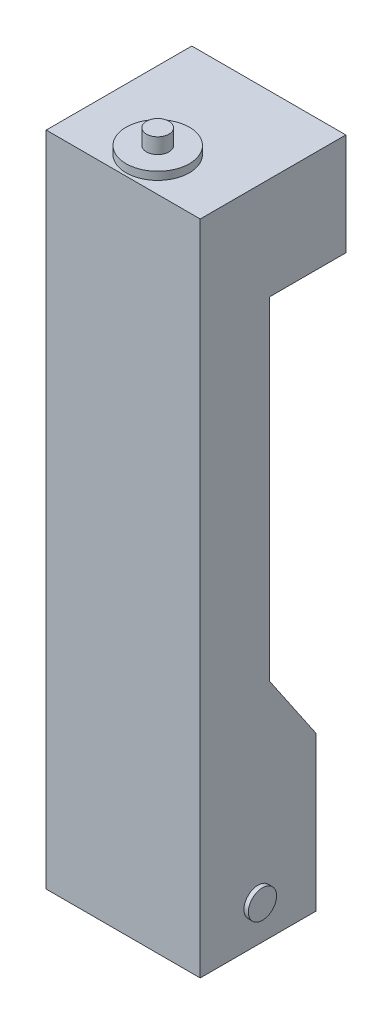
ISO-10303-21;
HEADER;
FILE_DESCRIPTION(('STEP AP214'),'2;1');
FILE_NAME('part.step','',(''),(''),'','','');
FILE_SCHEMA(('AUTOMOTIVE_DESIGN { 1 0 10303 214 1 1 1 1 }'));
ENDSEC;
DATA;
#1=APPLICATION_CONTEXT('core data for automotive mechanical design processes');
#2=APPLICATION_PROTOCOL_DEFINITION('international standard','automotive_design',2000,#1);
#3=PRODUCT_CONTEXT('',#1,'mechanical');
#4=PRODUCT('Part','Part','',(#3));
#5=PRODUCT_RELATED_PRODUCT_CATEGORY('part','',(#4));
#6=PRODUCT_DEFINITION_FORMATION('','',#4);
#7=PRODUCT_DEFINITION_CONTEXT('part definition',#1,'design');
#8=PRODUCT_DEFINITION('design','',#6,#7);
#9=PRODUCT_DEFINITION_SHAPE('','',#8);
#10=(LENGTH_UNIT() NAMED_UNIT(*) SI_UNIT(.MILLI.,.METRE.));
#11=(NAMED_UNIT(*) PLANE_ANGLE_UNIT() SI_UNIT($,.RADIAN.));
#12=(NAMED_UNIT(*) SI_UNIT($,.STERADIAN.) SOLID_ANGLE_UNIT());
#13=UNCERTAINTY_MEASURE_WITH_UNIT(LENGTH_MEASURE(1.E-05),#10,'distance_accuracy_value','');
#14=(GEOMETRIC_REPRESENTATION_CONTEXT(3) GLOBAL_UNCERTAINTY_ASSIGNED_CONTEXT((#13)) GLOBAL_UNIT_ASSIGNED_CONTEXT((#10,
#11,#12)) REPRESENTATION_CONTEXT('',''));
#15=CARTESIAN_POINT('',(0.,0.,0.));
#16=DIRECTION('',(0.,0.,1.));
#17=DIRECTION('',(1.,0.,0.));
#18=AXIS2_PLACEMENT_3D('',#15,#16,#17);
#19=CARTESIAN_POINT('',(-17.8,179.95,20.1));
#20=DIRECTION('',(0.,-1.,0.));
#21=DIRECTION('',(0.,0.,-1.));
#22=AXIS2_PLACEMENT_3D('',#19,#20,#21);
#23=PLANE('',#22);
#24=DIRECTION('',(-1.,0.,0.));
#25=VECTOR('',#24,1.);
#26=CARTESIAN_POINT('',(26.7625,179.95,-3.9));
#27=LINE('',#26,#25);
#28=CARTESIAN_POINT('',(26.7625,179.95,-3.9));
#29=VERTEX_POINT('',#28);
#30=CARTESIAN_POINT('',(-26.7625,179.95,-3.9));
#31=VERTEX_POINT('',#30);
#32=EDGE_CURVE('E230',#29,#31,#27,.T.);
#33=ORIENTED_EDGE('',*,*,#32,.T.);
#34=DIRECTION('',(0.,0.,1.));
#35=VECTOR('',#34,1.);
#36=CARTESIAN_POINT('',(-26.7625,179.95,-30.5));
#37=LINE('',#36,#35);
#38=CARTESIAN_POINT('',(-26.7625,179.95,-30.5));
#39=VERTEX_POINT('',#38);
#40=EDGE_CURVE('E218',#39,#31,#37,.T.);
#41=ORIENTED_EDGE('',*,*,#40,.F.);
#42=DIRECTION('',(-1.,0.,0.));
#43=VECTOR('',#42,1.);
#44=CARTESIAN_POINT('',(17.8,179.95,-30.5));
#45=LINE('',#44,#43);
#46=CARTESIAN_POINT('',(26.7625,179.95,-30.5));
#47=VERTEX_POINT('',#46);
#48=EDGE_CURVE('E247',#47,#39,#45,.T.);
#49=ORIENTED_EDGE('',*,*,#48,.F.);
#50=DIRECTION('',(0.,0.,-1.));
#51=VECTOR('',#50,1.);
#52=CARTESIAN_POINT('',(26.7625,179.95,20.1));
#53=LINE('',#52,#51);
#54=EDGE_CURVE('E231',#29,#47,#53,.T.);
#55=ORIENTED_EDGE('',*,*,#54,.F.);
#56=EDGE_LOOP('',(#33,#41,#49,#55));
#57=FACE_BOUND('',#56,.T.);
#58=ADVANCED_FACE('F33',(#57),#23,.T.);
#59=CARTESIAN_POINT('',(26.7625,64.4235294117647,-3.9));
#60=DIRECTION('',(0.,0.,1.));
#61=DIRECTION('',(0.,-1.,0.));
#62=AXIS2_PLACEMENT_3D('',#59,#60,#61);
#63=PLANE('',#62);
#64=DIRECTION('',(-1.,0.,0.));
#65=VECTOR('',#64,1.);
#66=CARTESIAN_POINT('',(26.7625,64.4235294117647,-3.9));
#67=LINE('',#66,#65);
#68=CARTESIAN_POINT('',(26.7625,64.4235294117647,-3.9));
#69=VERTEX_POINT('',#68);
#70=CARTESIAN_POINT('',(-26.7625,64.4235294117647,-3.9));
#71=VERTEX_POINT('',#70);
#72=EDGE_CURVE('E277',#69,#71,#67,.T.);
#73=ORIENTED_EDGE('',*,*,#72,.T.);
#74=DIRECTION('',(0.,1.,0.));
#75=VECTOR('',#74,1.);
#76=CARTESIAN_POINT('',(-26.7625,64.4235294117647,-3.9));
#77=LINE('',#76,#75);
#78=EDGE_CURVE('E256',#71,#31,#77,.T.);
#79=ORIENTED_EDGE('',*,*,#78,.T.);
#80=ORIENTED_EDGE('',*,*,#32,.F.);
#81=DIRECTION('',(0.,1.,0.));
#82=VECTOR('',#81,1.);
#83=CARTESIAN_POINT('',(26.7625,64.4235294117647,-3.9));
#84=LINE('',#83,#82);
#85=EDGE_CURVE('E272',#69,#29,#84,.T.);
#86=ORIENTED_EDGE('',*,*,#85,.F.);
#87=EDGE_LOOP('',(#73,#79,#80,#86));
#88=FACE_BOUND('',#87,.T.);
#89=ADVANCED_FACE('F344',(#88),#63,.F.);
#90=CARTESIAN_POINT('',(0.,218.2,8.1));
#91=DIRECTION('',(0.,1.,0.));
#92=DIRECTION('',(0.,0.,1.));
#93=AXIS2_PLACEMENT_3D('',#90,#91,#92);
#94=PLANE('',#93);
#95=CARTESIAN_POINT('',(0.,218.2,8.1));
#96=DIRECTION('',(0.,1.,0.));
#97=DIRECTION('',(0.,0.,1.));
#98=AXIS2_PLACEMENT_3D('',#95,#96,#97);
#99=CIRCLE('',#98,11.);
#100=CARTESIAN_POINT('',(0.,218.2,19.1));
#101=VERTEX_POINT('',#100);
#102=EDGE_CURVE('E241',#101,#101,#99,.T.);
#103=ORIENTED_EDGE('',*,*,#102,.T.);
#104=EDGE_LOOP('',(#103));
#105=FACE_BOUND('',#104,.T.);
#106=CARTESIAN_POINT('',(0.,218.2,8.1));
#107=DIRECTION('',(0.,1.,0.));
#108=DIRECTION('',(0.,0.,1.));
#109=AXIS2_PLACEMENT_3D('',#106,#107,#108);
#110=CIRCLE('',#109,3.9);
#111=CARTESIAN_POINT('',(0.,218.2,12.));
#112=VERTEX_POINT('',#111);
#113=EDGE_CURVE('E237',#112,#112,#110,.T.);
#114=ORIENTED_EDGE('',*,*,#113,.F.);
#115=EDGE_LOOP('',(#114));
#116=FACE_BOUND('',#115,.T.);
#117=ADVANCED_FACE('F334',(#105,#116),#94,.T.);
#118=CARTESIAN_POINT('',(-17.8,215.45,20.1));
#119=DIRECTION('',(0.,-1.,0.));
#120=DIRECTION('',(0.,0.,-1.));
#121=AXIS2_PLACEMENT_3D('',#118,#119,#120);
#122=PLANE('',#121);
#123=DIRECTION('',(-1.,0.,0.));
#124=VECTOR('',#123,1.);
#125=CARTESIAN_POINT('',(17.8,215.45,-30.5));
#126=LINE('',#125,#124);
#127=CARTESIAN_POINT('',(26.7625,215.45,-30.5));
#128=VERTEX_POINT('',#127);
#129=CARTESIAN_POINT('',(-26.7625,215.45,-30.5));
#130=VERTEX_POINT('',#129);
#131=EDGE_CURVE('E249',#128,#130,#126,.T.);
#132=ORIENTED_EDGE('',*,*,#131,.T.);
#133=DIRECTION('',(0.,0.,-1.));
#134=VECTOR('',#133,1.);
#135=CARTESIAN_POINT('',(-26.7625,215.45,-30.5));
#136=LINE('',#135,#134);
#137=CARTESIAN_POINT('',(-26.7625,215.45,20.1));
#138=VERTEX_POINT('',#137);
#139=EDGE_CURVE('E217',#138,#130,#136,.T.);
#140=ORIENTED_EDGE('',*,*,#139,.F.);
#141=DIRECTION('',(1.,0.,0.));
#142=VECTOR('',#141,1.);
#143=CARTESIAN_POINT('',(17.8,215.45,20.1));
#144=LINE('',#143,#142);
#145=CARTESIAN_POINT('',(26.7625,215.45,20.1));
#146=VERTEX_POINT('',#145);
#147=EDGE_CURVE('E246',#138,#146,#144,.T.);
#148=ORIENTED_EDGE('',*,*,#147,.T.);
#149=DIRECTION('',(0.,0.,1.));
#150=VECTOR('',#149,1.);
#151=CARTESIAN_POINT('',(26.7625,215.45,20.1));
#152=LINE('',#151,#150);
#153=EDGE_CURVE('E221',#128,#146,#152,.T.);
#154=ORIENTED_EDGE('',*,*,#153,.F.);
#155=EDGE_LOOP('',(#132,#140,#148,#154));
#156=FACE_BOUND('',#155,.T.);
#157=CARTESIAN_POINT('',(0.,215.45,8.1));
#158=DIRECTION('',(0.,-1.,0.));
#159=DIRECTION('',(0.,0.,-1.));
#160=AXIS2_PLACEMENT_3D('',#157,#158,#159);
#161=CIRCLE('',#160,11.);
#162=CARTESIAN_POINT('',(0.,215.45,-2.9));
#163=VERTEX_POINT('',#162);
#164=EDGE_CURVE('E207',#163,#163,#161,.F.);
#165=ORIENTED_EDGE('',*,*,#164,.F.);
#166=EDGE_LOOP('',(#165));
#167=FACE_BOUND('',#166,.T.);
#168=ADVANCED_FACE('F331',(#156,#167),#122,.F.);
#169=CARTESIAN_POINT('',(-20.5,48.1,-20.1));
#170=DIRECTION('',(1.,0.,0.));
#171=DIRECTION('',(0.,0.,-1.));
#172=AXIS2_PLACEMENT_3D('',#169,#170,#171);
#173=PLANE('',#172);
#174=DIRECTION('',(0.,-0.826926502069529,0.562310021407278));
#175=VECTOR('',#174,1.);
#176=CARTESIAN_POINT('',(-20.5,-13.,-15.));
#177=LINE('',#176,#175);
#178=CARTESIAN_POINT('',(-20.5,-5.52324803401495,-20.0841913368698));
#179=VERTEX_POINT('',#178);
#180=CARTESIAN_POINT('',(-20.5,-5.49999999999996,-20.1));
#181=VERTEX_POINT('',#180);
#182=EDGE_CURVE('E306',#179,#181,#177,.F.);
#183=ORIENTED_EDGE('',*,*,#182,.F.);
#184=DIRECTION('',(0.,1.,0.));
#185=VECTOR('',#184,1.);
#186=CARTESIAN_POINT('',(-20.5,48.1,-20.0841913368698));
#187=LINE('',#186,#185);
#188=CARTESIAN_POINT('',(-20.5,15.2,-20.0841913368698));
#189=VERTEX_POINT('',#188);
#190=EDGE_CURVE('E196',#179,#189,#187,.T.);
#191=ORIENTED_EDGE('',*,*,#190,.T.);
#192=DIRECTION('',(0.,0.,1.));
#193=VECTOR('',#192,1.);
#194=CARTESIAN_POINT('',(-20.5,15.2,-20.1));
#195=LINE('',#194,#193);
#196=CARTESIAN_POINT('',(-20.5,15.2,-20.1));
#197=VERTEX_POINT('',#196);
#198=EDGE_CURVE('E292',#197,#189,#195,.T.);
#199=ORIENTED_EDGE('',*,*,#198,.F.);
#200=DIRECTION('',(0.,-1.,0.));
#201=VECTOR('',#200,1.);
#202=CARTESIAN_POINT('',(-20.5,48.1,-20.1));
#203=LINE('',#202,#201);
#204=EDGE_CURVE('E320',#197,#181,#203,.T.);
#205=ORIENTED_EDGE('',*,*,#204,.T.);
#206=EDGE_LOOP('',(#183,#191,#199,#205));
#207=FACE_BOUND('',#206,.T.);
#208=ADVANCED_FACE('F333',(#207),#173,.F.);
#209=CARTESIAN_POINT('',(20.5,48.1,-20.1));
#210=DIRECTION('',(-1.,0.,0.));
#211=DIRECTION('',(0.,0.,1.));
#212=AXIS2_PLACEMENT_3D('',#209,#210,#211);
#213=PLANE('',#212);
#214=DIRECTION('',(0.,0.,1.));
#215=VECTOR('',#214,1.);
#216=CARTESIAN_POINT('',(20.5,15.2,-20.1));
#217=LINE('',#216,#215);
#218=CARTESIAN_POINT('',(20.5,15.2,-20.1));
#219=VERTEX_POINT('',#218);
#220=CARTESIAN_POINT('',(20.5,15.2,-20.0841913368698));
#221=VERTEX_POINT('',#220);
#222=EDGE_CURVE('E279',#219,#221,#217,.T.);
#223=ORIENTED_EDGE('',*,*,#222,.T.);
#224=DIRECTION('',(0.,-1.,0.));
#225=VECTOR('',#224,1.);
#226=CARTESIAN_POINT('',(20.5,48.1,-20.0841913368698));
#227=LINE('',#226,#225);
#228=CARTESIAN_POINT('',(20.5,-5.52324803401495,-20.0841913368698));
#229=VERTEX_POINT('',#228);
#230=EDGE_CURVE('E191',#221,#229,#227,.T.);
#231=ORIENTED_EDGE('',*,*,#230,.T.);
#232=DIRECTION('',(0.,0.826926502069529,-0.562310021407278));
#233=VECTOR('',#232,1.);
#234=CARTESIAN_POINT('',(20.5,-13.,-15.));
#235=LINE('',#234,#233);
#236=CARTESIAN_POINT('',(20.5,-5.49999999999996,-20.1));
#237=VERTEX_POINT('',#236);
#238=EDGE_CURVE('E300',#237,#229,#235,.F.);
#239=ORIENTED_EDGE('',*,*,#238,.F.);
#240=DIRECTION('',(0.,-1.,0.));
#241=VECTOR('',#240,1.);
#242=CARTESIAN_POINT('',(20.5,48.1,-20.1));
#243=LINE('',#242,#241);
#244=EDGE_CURVE('E323',#219,#237,#243,.T.);
#245=ORIENTED_EDGE('',*,*,#244,.F.);
#246=EDGE_LOOP('',(#223,#231,#239,#245));
#247=FACE_BOUND('',#246,.T.);
#248=ADVANCED_FACE('F342',(#247),#213,.F.);
#249=CARTESIAN_POINT('',(20.5,48.1,-20.1));
#250=DIRECTION('',(0.,0.,1.));
#251=DIRECTION('',(1.,0.,0.));
#252=AXIS2_PLACEMENT_3D('',#249,#250,#251);
#253=PLANE('',#252);
#254=DIRECTION('',(1.,0.,0.));
#255=VECTOR('',#254,1.);
#256=CARTESIAN_POINT('',(20.5,-5.49999999999996,-20.1));
#257=LINE('',#256,#255);
#258=EDGE_CURVE('E303',#181,#237,#257,.T.);
#259=ORIENTED_EDGE('',*,*,#258,.F.);
#260=ORIENTED_EDGE('',*,*,#204,.F.);
#261=DIRECTION('',(1.,0.,0.));
#262=VECTOR('',#261,1.);
#263=CARTESIAN_POINT('',(-22.,15.2,-20.1));
#264=LINE('',#263,#262);
#265=CARTESIAN_POINT('',(-26.7625,15.2,-20.1));
#266=VERTEX_POINT('',#265);
#267=EDGE_CURVE('E297',#266,#197,#264,.T.);
#268=ORIENTED_EDGE('',*,*,#267,.F.);
#269=DIRECTION('',(0.,1.,0.));
#270=VECTOR('',#269,1.);
#271=CARTESIAN_POINT('',(-26.7625,15.2,-20.1));
#272=LINE('',#271,#270);
#273=CARTESIAN_POINT('',(-26.7625,40.6,-20.1));
#274=VERTEX_POINT('',#273);
#275=EDGE_CURVE('E262',#266,#274,#272,.T.);
#276=ORIENTED_EDGE('',*,*,#275,.T.);
#277=DIRECTION('',(1.,0.,0.));
#278=VECTOR('',#277,1.);
#279=CARTESIAN_POINT('',(20.5,40.6,-20.1));
#280=LINE('',#279,#278);
#281=CARTESIAN_POINT('',(26.7625,40.6,-20.1));
#282=VERTEX_POINT('',#281);
#283=EDGE_CURVE('E325',#274,#282,#280,.T.);
#284=ORIENTED_EDGE('',*,*,#283,.T.);
#285=DIRECTION('',(0.,1.,0.));
#286=VECTOR('',#285,1.);
#287=CARTESIAN_POINT('',(26.7625,15.2,-20.1));
#288=LINE('',#287,#286);
#289=CARTESIAN_POINT('',(26.7625,15.2,-20.1));
#290=VERTEX_POINT('',#289);
#291=EDGE_CURVE('E267',#290,#282,#288,.T.);
#292=ORIENTED_EDGE('',*,*,#291,.F.);
#293=DIRECTION('',(-1.,0.,0.));
#294=VECTOR('',#293,1.);
#295=CARTESIAN_POINT('',(22.,15.2,-20.1));
#296=LINE('',#295,#294);
#297=EDGE_CURVE('E282',#290,#219,#296,.T.);
#298=ORIENTED_EDGE('',*,*,#297,.T.);
#299=ORIENTED_EDGE('',*,*,#244,.T.);
#300=EDGE_LOOP('',(#259,#260,#268,#276,#284,#292,#298,#299));
#301=FACE_BOUND('',#300,.T.);
#302=ADVANCED_FACE('F430',(#301),#253,.F.);
#303=CARTESIAN_POINT('',(20.5,48.1,20.1));
#304=DIRECTION('',(0.,0.,-1.));
#305=DIRECTION('',(-1.,0.,0.));
#306=AXIS2_PLACEMENT_3D('',#303,#304,#305);
#307=PLANE('',#306);
#308=DIRECTION('',(-1.,0.,0.));
#309=VECTOR('',#308,1.);
#310=CARTESIAN_POINT('',(-26.7625,-13.,20.1));
#311=LINE('',#310,#309);
#312=CARTESIAN_POINT('',(26.7625,-13.,20.1));
#313=VERTEX_POINT('',#312);
#314=CARTESIAN_POINT('',(-26.7625,-13.,20.1));
#315=VERTEX_POINT('',#314);
#316=EDGE_CURVE('E171',#313,#315,#311,.T.);
#317=ORIENTED_EDGE('',*,*,#316,.F.);
#318=DIRECTION('',(0.,-1.,0.));
#319=VECTOR('',#318,1.);
#320=CARTESIAN_POINT('',(26.7625,215.2,20.1));
#321=LINE('',#320,#319);
#322=EDGE_CURVE('E275',#146,#313,#321,.T.);
#323=ORIENTED_EDGE('',*,*,#322,.F.);
#324=ORIENTED_EDGE('',*,*,#147,.F.);
#325=DIRECTION('',(0.,-1.,0.));
#326=VECTOR('',#325,1.);
#327=CARTESIAN_POINT('',(-26.7625,215.2,20.1));
#328=LINE('',#327,#326);
#329=EDGE_CURVE('E254',#138,#315,#328,.T.);
#330=ORIENTED_EDGE('',*,*,#329,.T.);
#331=EDGE_LOOP('',(#317,#323,#324,#330));
#332=FACE_BOUND('',#331,.T.);
#333=ADVANCED_FACE('F433',(#332),#307,.F.);
#334=CARTESIAN_POINT('',(-20.5,48.1,-15.));
#335=DIRECTION('',(0.,-0.562310021407278,0.826926502069529));
#336=DIRECTION('',(0.,-0.826926502069529,-0.562310021407278));
#337=AXIS2_PLACEMENT_3D('',#334,#335,#336);
#338=PLANE('',#337);
#339=DIRECTION('',(0.,0.826926502069529,0.562310021407278));
#340=VECTOR('',#339,1.);
#341=CARTESIAN_POINT('',(-26.7625,40.6,-20.1));
#342=LINE('',#341,#340);
#343=EDGE_CURVE('E259',#274,#71,#342,.T.);
#344=ORIENTED_EDGE('',*,*,#343,.T.);
#345=ORIENTED_EDGE('',*,*,#72,.F.);
#346=DIRECTION('',(0.,0.826926502069529,0.562310021407278));
#347=VECTOR('',#346,1.);
#348=CARTESIAN_POINT('',(26.7625,40.6,-20.1));
#349=LINE('',#348,#347);
#350=EDGE_CURVE('E270',#282,#69,#349,.T.);
#351=ORIENTED_EDGE('',*,*,#350,.F.);
#352=ORIENTED_EDGE('',*,*,#283,.F.);
#353=EDGE_LOOP('',(#344,#345,#351,#352));
#354=FACE_BOUND('',#353,.T.);
#355=ADVANCED_FACE('F35',(#354),#338,.F.);
#356=CARTESIAN_POINT('',(-20.5,-13.,-15.));
#357=DIRECTION('',(0.,0.562310021407278,0.826926502069529));
#358=DIRECTION('',(0.,0.826926502069529,-0.562310021407278));
#359=AXIS2_PLACEMENT_3D('',#356,#357,#358);
#360=PLANE('',#359);
#361=DIRECTION('',(-1.,0.,0.));
#362=VECTOR('',#361,1.);
#363=CARTESIAN_POINT('',(-20.5,-5.52324803401495,-20.0841913368698));
#364=LINE('',#363,#362);
#365=EDGE_CURVE('E194',#179,#229,#364,.F.);
#366=ORIENTED_EDGE('',*,*,#365,.F.);
#367=ORIENTED_EDGE('',*,*,#182,.T.);
#368=ORIENTED_EDGE('',*,*,#258,.T.);
#369=ORIENTED_EDGE('',*,*,#238,.T.);
#370=EDGE_LOOP('',(#366,#367,#368,#369));
#371=FACE_BOUND('',#370,.T.);
#372=ADVANCED_FACE('F407',(#371),#360,.F.);
#373=CARTESIAN_POINT('',(-22.,15.2,-20.1));
#374=DIRECTION('',(0.,1.,0.));
#375=DIRECTION('',(0.,0.,1.));
#376=AXIS2_PLACEMENT_3D('',#373,#374,#375);
#377=PLANE('',#376);
#378=ORIENTED_EDGE('',*,*,#198,.T.);
#379=DIRECTION('',(-1.,0.,0.));
#380=VECTOR('',#379,1.);
#381=CARTESIAN_POINT('',(-22.,15.2,-20.0841913368698));
#382=LINE('',#381,#380);
#383=CARTESIAN_POINT('',(-26.7625,15.2,-20.0841913368698));
#384=VERTEX_POINT('',#383);
#385=EDGE_CURVE('E199',#189,#384,#382,.T.);
#386=ORIENTED_EDGE('',*,*,#385,.T.);
#387=DIRECTION('',(0.,0.,-1.));
#388=VECTOR('',#387,1.);
#389=CARTESIAN_POINT('',(-26.7625,15.2,-4.9));
#390=LINE('',#389,#388);
#391=EDGE_CURVE('E167',#384,#266,#390,.T.);
#392=ORIENTED_EDGE('',*,*,#391,.T.);
#393=ORIENTED_EDGE('',*,*,#267,.T.);
#394=EDGE_LOOP('',(#378,#386,#392,#393));
#395=FACE_BOUND('',#394,.T.);
#396=ADVANCED_FACE('F404',(#395),#377,.F.);
#397=CARTESIAN_POINT('',(22.,15.2,-20.1));
#398=DIRECTION('',(0.,-1.,0.));
#399=DIRECTION('',(0.,0.,-1.));
#400=AXIS2_PLACEMENT_3D('',#397,#398,#399);
#401=PLANE('',#400);
#402=DIRECTION('',(1.,0.,0.));
#403=VECTOR('',#402,1.);
#404=CARTESIAN_POINT('',(22.,15.2,-20.0841913368698));
#405=LINE('',#404,#403);
#406=CARTESIAN_POINT('',(26.7625,15.2,-20.0841913368698));
#407=VERTEX_POINT('',#406);
#408=EDGE_CURVE('E188',#221,#407,#405,.T.);
#409=ORIENTED_EDGE('',*,*,#408,.F.);
#410=ORIENTED_EDGE('',*,*,#222,.F.);
#411=ORIENTED_EDGE('',*,*,#297,.F.);
#412=DIRECTION('',(0.,0.,-1.));
#413=VECTOR('',#412,1.);
#414=CARTESIAN_POINT('',(26.7625,15.2,-4.9));
#415=LINE('',#414,#413);
#416=EDGE_CURVE('E265',#407,#290,#415,.T.);
#417=ORIENTED_EDGE('',*,*,#416,.F.);
#418=EDGE_LOOP('',(#409,#410,#411,#417));
#419=FACE_BOUND('',#418,.T.);
#420=ADVANCED_FACE('F389',(#419),#401,.T.);
#421=CARTESIAN_POINT('',(26.7625,15.2,-20.1));
#422=DIRECTION('',(1.,0.,0.));
#423=DIRECTION('',(0.,0.,-1.));
#424=AXIS2_PLACEMENT_3D('',#421,#422,#423);
#425=PLANE('',#424);
#426=DIRECTION('',(0.,-1.,0.));
#427=VECTOR('',#426,1.);
#428=CARTESIAN_POINT('',(26.7625,31.,-20.0841913368698));
#429=LINE('',#428,#427);
#430=CARTESIAN_POINT('',(26.7625,-13.,-20.0841913368698));
#431=VERTEX_POINT('',#430);
#432=EDGE_CURVE('E170',#407,#431,#429,.T.);
#433=ORIENTED_EDGE('',*,*,#432,.F.);
#434=ORIENTED_EDGE('',*,*,#416,.T.);
#435=ORIENTED_EDGE('',*,*,#291,.T.);
#436=ORIENTED_EDGE('',*,*,#350,.T.);
#437=ORIENTED_EDGE('',*,*,#85,.T.);
#438=ORIENTED_EDGE('',*,*,#54,.T.);
#439=DIRECTION('',(0.,1.,0.));
#440=VECTOR('',#439,1.);
#441=CARTESIAN_POINT('',(26.7625,215.45,-30.5));
#442=LINE('',#441,#440);
#443=EDGE_CURVE('E227',#47,#128,#442,.T.);
#444=ORIENTED_EDGE('',*,*,#443,.T.);
#445=ORIENTED_EDGE('',*,*,#153,.T.);
#446=ORIENTED_EDGE('',*,*,#322,.T.);
#447=DIRECTION('',(0.,0.,1.));
#448=VECTOR('',#447,1.);
#449=CARTESIAN_POINT('',(26.7625,-13.,20.1));
#450=LINE('',#449,#448);
#451=EDGE_CURVE('E180',#431,#313,#450,.T.);
#452=ORIENTED_EDGE('',*,*,#451,.F.);
#453=EDGE_LOOP('',(#433,#434,#435,#436,#437,#438,#444,#445,#446,#452));
#454=FACE_BOUND('',#453,.T.);
#455=CARTESIAN_POINT('',(26.7625,0.,0.));
#456=DIRECTION('',(1.,0.,0.));
#457=DIRECTION('',(0.,0.,-1.));
#458=AXIS2_PLACEMENT_3D('',#455,#456,#457);
#459=CIRCLE('',#458,4.9);
#460=CARTESIAN_POINT('',(26.7625,0.,-4.9));
#461=VERTEX_POINT('',#460);
#462=EDGE_CURVE('E41',#461,#461,#459,.F.);
#463=ORIENTED_EDGE('',*,*,#462,.T.);
#464=EDGE_LOOP('',(#463));
#465=FACE_BOUND('',#464,.T.);
#466=ADVANCED_FACE('F462',(#454,#465),#425,.T.);
#467=CARTESIAN_POINT('',(-26.7625,15.2,-20.1));
#468=DIRECTION('',(-1.,0.,0.));
#469=DIRECTION('',(0.,0.,-1.));
#470=AXIS2_PLACEMENT_3D('',#467,#468,#469);
#471=PLANE('',#470);
#472=ORIENTED_EDGE('',*,*,#391,.F.);
#473=DIRECTION('',(0.,-1.,0.));
#474=VECTOR('',#473,1.);
#475=CARTESIAN_POINT('',(-26.7625,31.,-20.0841913368698));
#476=LINE('',#475,#474);
#477=CARTESIAN_POINT('',(-26.7625,-13.,-20.0841913368698));
#478=VERTEX_POINT('',#477);
#479=EDGE_CURVE('E159',#384,#478,#476,.T.);
#480=ORIENTED_EDGE('',*,*,#479,.T.);
#481=DIRECTION('',(0.,0.,-1.));
#482=VECTOR('',#481,1.);
#483=CARTESIAN_POINT('',(-26.7625,-13.,20.1));
#484=LINE('',#483,#482);
#485=EDGE_CURVE('E164',#315,#478,#484,.T.);
#486=ORIENTED_EDGE('',*,*,#485,.F.);
#487=ORIENTED_EDGE('',*,*,#329,.F.);
#488=ORIENTED_EDGE('',*,*,#139,.T.);
#489=DIRECTION('',(0.,-1.,0.));
#490=VECTOR('',#489,1.);
#491=CARTESIAN_POINT('',(-26.7625,215.45,-30.5));
#492=LINE('',#491,#490);
#493=EDGE_CURVE('E222',#130,#39,#492,.T.);
#494=ORIENTED_EDGE('',*,*,#493,.T.);
#495=ORIENTED_EDGE('',*,*,#40,.T.);
#496=ORIENTED_EDGE('',*,*,#78,.F.);
#497=ORIENTED_EDGE('',*,*,#343,.F.);
#498=ORIENTED_EDGE('',*,*,#275,.F.);
#499=EDGE_LOOP('',(#472,#480,#486,#487,#488,#494,#495,#496,#497,#498));
#500=FACE_BOUND('',#499,.T.);
#501=CARTESIAN_POINT('',(-26.7625,0.,0.));
#502=DIRECTION('',(-1.,0.,0.));
#503=DIRECTION('',(0.,0.,1.));
#504=AXIS2_PLACEMENT_3D('',#501,#502,#503);
#505=CIRCLE('',#504,4.9);
#506=CARTESIAN_POINT('',(-26.7625,0.,4.9));
#507=VERTEX_POINT('',#506);
#508=EDGE_CURVE('E201',#507,#507,#505,.T.);
#509=ORIENTED_EDGE('',*,*,#508,.F.);
#510=EDGE_LOOP('',(#509));
#511=FACE_BOUND('',#510,.T.);
#512=ADVANCED_FACE('F161',(#500,#511),#471,.T.);
#513=CARTESIAN_POINT('',(17.8,179.95,-30.5));
#514=DIRECTION('',(0.,0.,-1.));
#515=DIRECTION('',(-1.,0.,0.));
#516=AXIS2_PLACEMENT_3D('',#513,#514,#515);
#517=PLANE('',#516);
#518=ORIENTED_EDGE('',*,*,#131,.F.);
#519=ORIENTED_EDGE('',*,*,#443,.F.);
#520=ORIENTED_EDGE('',*,*,#48,.T.);
#521=ORIENTED_EDGE('',*,*,#493,.F.);
#522=EDGE_LOOP('',(#518,#519,#520,#521));
#523=FACE_BOUND('',#522,.T.);
#524=ADVANCED_FACE('F359',(#523),#517,.T.);
#525=CARTESIAN_POINT('',(0.,218.2,8.1));
#526=DIRECTION('',(0.,-1.,0.));
#527=DIRECTION('',(0.,0.,-1.));
#528=AXIS2_PLACEMENT_3D('',#525,#526,#527);
#529=CYLINDRICAL_SURFACE('',#528,11.);
#530=ORIENTED_EDGE('',*,*,#102,.F.);
#531=EDGE_LOOP('',(#530));
#532=FACE_BOUND('',#531,.T.);
#533=ORIENTED_EDGE('',*,*,#164,.T.);
#534=EDGE_LOOP('',(#533));
#535=FACE_BOUND('',#534,.T.);
#536=ADVANCED_FACE('F329',(#532,#535),#529,.T.);
#537=CARTESIAN_POINT('',(0.,223.55,8.1));
#538=DIRECTION('',(0.,-1.,0.));
#539=DIRECTION('',(0.,0.,-1.));
#540=AXIS2_PLACEMENT_3D('',#537,#538,#539);
#541=CYLINDRICAL_SURFACE('',#540,3.9);
#542=CARTESIAN_POINT('',(0.,223.55,8.1));
#543=DIRECTION('',(0.,1.,0.));
#544=DIRECTION('',(0.,0.,1.));
#545=AXIS2_PLACEMENT_3D('',#542,#543,#544);
#546=CIRCLE('',#545,3.9);
#547=CARTESIAN_POINT('',(0.,223.55,12.));
#548=VERTEX_POINT('',#547);
#549=EDGE_CURVE('E238',#548,#548,#546,.T.);
#550=ORIENTED_EDGE('',*,*,#549,.F.);
#551=EDGE_LOOP('',(#550));
#552=FACE_BOUND('',#551,.T.);
#553=ORIENTED_EDGE('',*,*,#113,.T.);
#554=EDGE_LOOP('',(#553));
#555=FACE_BOUND('',#554,.T.);
#556=ADVANCED_FACE('F358',(#552,#555),#541,.T.);
#557=CARTESIAN_POINT('',(0.,223.55,8.1));
#558=DIRECTION('',(0.,1.,0.));
#559=DIRECTION('',(0.,0.,1.));
#560=AXIS2_PLACEMENT_3D('',#557,#558,#559);
#561=PLANE('',#560);
#562=ORIENTED_EDGE('',*,*,#549,.T.);
#563=EDGE_LOOP('',(#562));
#564=FACE_BOUND('',#563,.T.);
#565=ADVANCED_FACE('F364',(#564),#561,.T.);
#566=CARTESIAN_POINT('',(-26.7625,31.,-20.0841913368698));
#567=DIRECTION('',(0.,0.,-1.));
#568=DIRECTION('',(-1.,0.,0.));
#569=AXIS2_PLACEMENT_3D('',#566,#567,#568);
#570=PLANE('',#569);
#571=ORIENTED_EDGE('',*,*,#385,.F.);
#572=ORIENTED_EDGE('',*,*,#190,.F.);
#573=ORIENTED_EDGE('',*,*,#365,.T.);
#574=ORIENTED_EDGE('',*,*,#230,.F.);
#575=ORIENTED_EDGE('',*,*,#408,.T.);
#576=ORIENTED_EDGE('',*,*,#432,.T.);
#577=DIRECTION('',(1.,0.,0.));
#578=VECTOR('',#577,1.);
#579=CARTESIAN_POINT('',(-26.7625,-13.,-20.0841913368698));
#580=LINE('',#579,#578);
#581=EDGE_CURVE('E174',#478,#431,#580,.T.);
#582=ORIENTED_EDGE('',*,*,#581,.F.);
#583=ORIENTED_EDGE('',*,*,#479,.F.);
#584=EDGE_LOOP('',(#571,#572,#573,#574,#575,#576,#582,#583));
#585=FACE_BOUND('',#584,.T.);
#586=ADVANCED_FACE('F175',(#585),#570,.T.);
#587=CARTESIAN_POINT('',(28.3,0.,0.));
#588=DIRECTION('',(1.,0.,0.));
#589=DIRECTION('',(0.,0.,1.));
#590=AXIS2_PLACEMENT_3D('',#587,#588,#589);
#591=PLANE('',#590);
#592=CARTESIAN_POINT('',(28.3,0.,0.));
#593=DIRECTION('',(-1.,0.,0.));
#594=DIRECTION('',(0.,0.,1.));
#595=AXIS2_PLACEMENT_3D('',#592,#593,#594);
#596=CIRCLE('',#595,4.9);
#597=CARTESIAN_POINT('',(28.3,0.,4.9));
#598=VERTEX_POINT('',#597);
#599=EDGE_CURVE('E285',#598,#598,#596,.T.);
#600=ORIENTED_EDGE('',*,*,#599,.F.);
#601=EDGE_LOOP('',(#600));
#602=FACE_BOUND('',#601,.T.);
#603=ADVANCED_FACE('F370',(#602),#591,.T.);
#604=CARTESIAN_POINT('',(28.3,0.,0.));
#605=DIRECTION('',(-1.,0.,0.));
#606=DIRECTION('',(0.,0.,1.));
#607=AXIS2_PLACEMENT_3D('',#604,#605,#606);
#608=CYLINDRICAL_SURFACE('',#607,4.9);
#609=ORIENTED_EDGE('',*,*,#462,.F.);
#610=EDGE_LOOP('',(#609));
#611=FACE_BOUND('',#610,.T.);
#612=ORIENTED_EDGE('',*,*,#599,.T.);
#613=EDGE_LOOP('',(#612));
#614=FACE_BOUND('',#613,.T.);
#615=ADVANCED_FACE('F376',(#611,#614),#608,.T.);
#616=CARTESIAN_POINT('',(-23.5,0.,0.));
#617=DIRECTION('',(1.,0.,0.));
#618=DIRECTION('',(0.,0.,-1.));
#619=AXIS2_PLACEMENT_3D('',#616,#617,#618);
#620=CYLINDRICAL_SURFACE('',#619,14.);
#621=CARTESIAN_POINT('',(-23.5,0.,0.));
#622=DIRECTION('',(-1.,0.,0.));
#623=DIRECTION('',(0.,0.,1.));
#624=AXIS2_PLACEMENT_3D('',#621,#622,#623);
#625=CIRCLE('',#624,14.);
#626=CARTESIAN_POINT('',(-23.5,-13.,-5.19615242270663));
#627=VERTEX_POINT('',#626);
#628=CARTESIAN_POINT('',(-23.5,-13.,5.19615242270663));
#629=VERTEX_POINT('',#628);
#630=EDGE_CURVE('E312',#627,#629,#625,.T.);
#631=ORIENTED_EDGE('',*,*,#630,.F.);
#632=DIRECTION('',(1.,0.,0.));
#633=VECTOR('',#632,1.);
#634=CARTESIAN_POINT('',(-23.5,-13.,-5.19615242270663));
#635=LINE('',#634,#633);
#636=CARTESIAN_POINT('',(-20.5,-13.,-5.19615242270663));
#637=VERTEX_POINT('',#636);
#638=EDGE_CURVE('E214',#627,#637,#635,.T.);
#639=ORIENTED_EDGE('',*,*,#638,.T.);
#640=CARTESIAN_POINT('',(-20.5,0.,0.));
#641=DIRECTION('',(-1.,0.,0.));
#642=DIRECTION('',(0.,0.,1.));
#643=AXIS2_PLACEMENT_3D('',#640,#641,#642);
#644=CIRCLE('',#643,14.);
#645=CARTESIAN_POINT('',(-20.5,-13.,5.19615242270663));
#646=VERTEX_POINT('',#645);
#647=EDGE_CURVE('E311',#637,#646,#644,.T.);
#648=ORIENTED_EDGE('',*,*,#647,.T.);
#649=DIRECTION('',(1.,0.,0.));
#650=VECTOR('',#649,1.);
#651=CARTESIAN_POINT('',(-23.5,-13.,5.19615242270663));
#652=LINE('',#651,#650);
#653=EDGE_CURVE('E48',#646,#629,#652,.F.);
#654=ORIENTED_EDGE('',*,*,#653,.T.);
#655=EDGE_LOOP('',(#631,#639,#648,#654));
#656=FACE_BOUND('',#655,.T.);
#657=ADVANCED_FACE('F384',(#656),#620,.T.);
#658=CARTESIAN_POINT('',(-23.5,0.,0.));
#659=DIRECTION('',(-1.,0.,0.));
#660=DIRECTION('',(0.,0.,1.));
#661=AXIS2_PLACEMENT_3D('',#658,#659,#660);
#662=PLANE('',#661);
#663=DIRECTION('',(0.,0.,1.));
#664=VECTOR('',#663,1.);
#665=CARTESIAN_POINT('',(-23.5,-13.,0.));
#666=LINE('',#665,#664);
#667=EDGE_CURVE('E54',#627,#629,#666,.T.);
#668=ORIENTED_EDGE('',*,*,#667,.F.);
#669=ORIENTED_EDGE('',*,*,#630,.T.);
#670=EDGE_LOOP('',(#668,#669));
#671=FACE_BOUND('',#670,.T.);
#672=ADVANCED_FACE('F419',(#671),#662,.T.);
#673=CARTESIAN_POINT('',(-20.5,0.,0.));
#674=DIRECTION('',(-1.,0.,0.));
#675=DIRECTION('',(0.,0.,1.));
#676=AXIS2_PLACEMENT_3D('',#673,#674,#675);
#677=PLANE('',#676);
#678=ORIENTED_EDGE('',*,*,#647,.F.);
#679=DIRECTION('',(0.,0.,1.));
#680=VECTOR('',#679,1.);
#681=CARTESIAN_POINT('',(-20.5,-13.,-20.1));
#682=LINE('',#681,#680);
#683=EDGE_CURVE('E314',#637,#646,#682,.T.);
#684=ORIENTED_EDGE('',*,*,#683,.T.);
#685=EDGE_LOOP('',(#678,#684));
#686=FACE_BOUND('',#685,.T.);
#687=ADVANCED_FACE('F422',(#686),#677,.F.);
#688=CARTESIAN_POINT('',(-20.5,-13.,20.1));
#689=DIRECTION('',(0.,-1.,0.));
#690=DIRECTION('',(0.,0.,-1.));
#691=AXIS2_PLACEMENT_3D('',#688,#689,#690);
#692=PLANE('',#691);
#693=ORIENTED_EDGE('',*,*,#683,.F.);
#694=ORIENTED_EDGE('',*,*,#638,.F.);
#695=ORIENTED_EDGE('',*,*,#667,.T.);
#696=ORIENTED_EDGE('',*,*,#653,.F.);
#697=EDGE_LOOP('',(#693,#694,#695,#696));
#698=FACE_BOUND('',#697,.T.);
#699=DIRECTION('',(0.,0.,-1.));
#700=VECTOR('',#699,1.);
#701=CARTESIAN_POINT('',(20.5,-13.,-20.1));
#702=LINE('',#701,#700);
#703=CARTESIAN_POINT('',(20.5,-13.,5.19615242270663));
#704=VERTEX_POINT('',#703);
#705=CARTESIAN_POINT('',(20.5,-13.,-5.19615242270663));
#706=VERTEX_POINT('',#705);
#707=EDGE_CURVE('E317',#704,#706,#702,.T.);
#708=ORIENTED_EDGE('',*,*,#707,.F.);
#709=DIRECTION('',(-1.,0.,0.));
#710=VECTOR('',#709,1.);
#711=CARTESIAN_POINT('',(23.5,-13.,5.19615242270663));
#712=LINE('',#711,#710);
#713=CARTESIAN_POINT('',(23.5,-13.,5.19615242270663));
#714=VERTEX_POINT('',#713);
#715=EDGE_CURVE('E210',#704,#714,#712,.F.);
#716=ORIENTED_EDGE('',*,*,#715,.T.);
#717=DIRECTION('',(0.,0.,-1.));
#718=VECTOR('',#717,1.);
#719=CARTESIAN_POINT('',(23.5,-13.,0.));
#720=LINE('',#719,#718);
#721=CARTESIAN_POINT('',(23.5,-13.,-5.19615242270663));
#722=VERTEX_POINT('',#721);
#723=EDGE_CURVE('E11',#714,#722,#720,.T.);
#724=ORIENTED_EDGE('',*,*,#723,.T.);
#725=DIRECTION('',(-1.,0.,0.));
#726=VECTOR('',#725,1.);
#727=CARTESIAN_POINT('',(23.5,-13.,-5.19615242270663));
#728=LINE('',#727,#726);
#729=EDGE_CURVE('E204',#722,#706,#728,.T.);
#730=ORIENTED_EDGE('',*,*,#729,.T.);
#731=EDGE_LOOP('',(#708,#716,#724,#730));
#732=FACE_BOUND('',#731,.T.);
#733=ORIENTED_EDGE('',*,*,#485,.T.);
#734=ORIENTED_EDGE('',*,*,#581,.T.);
#735=ORIENTED_EDGE('',*,*,#451,.T.);
#736=ORIENTED_EDGE('',*,*,#316,.T.);
#737=EDGE_LOOP('',(#733,#734,#735,#736));
#738=FACE_BOUND('',#737,.T.);
#739=ADVANCED_FACE('F182',(#698,#732,#738),#692,.T.);
#740=CARTESIAN_POINT('',(20.5,0.,0.));
#741=DIRECTION('',(1.,0.,0.));
#742=DIRECTION('',(0.,0.,1.));
#743=AXIS2_PLACEMENT_3D('',#740,#741,#742);
#744=PLANE('',#743);
#745=CARTESIAN_POINT('',(20.5,0.,0.));
#746=DIRECTION('',(-1.,0.,0.));
#747=DIRECTION('',(0.,0.,1.));
#748=AXIS2_PLACEMENT_3D('',#745,#746,#747);
#749=CIRCLE('',#748,14.);
#750=EDGE_CURVE('E288',#706,#704,#749,.T.);
#751=ORIENTED_EDGE('',*,*,#750,.T.);
#752=ORIENTED_EDGE('',*,*,#707,.T.);
#753=EDGE_LOOP('',(#751,#752));
#754=FACE_BOUND('',#753,.T.);
#755=ADVANCED_FACE('F395',(#754),#744,.F.);
#756=CARTESIAN_POINT('',(23.5,0.,0.));
#757=DIRECTION('',(1.,0.,0.));
#758=DIRECTION('',(0.,0.,1.));
#759=AXIS2_PLACEMENT_3D('',#756,#757,#758);
#760=PLANE('',#759);
#761=ORIENTED_EDGE('',*,*,#723,.F.);
#762=CARTESIAN_POINT('',(23.5,0.,0.));
#763=DIRECTION('',(-1.,0.,0.));
#764=DIRECTION('',(0.,0.,1.));
#765=AXIS2_PLACEMENT_3D('',#762,#763,#764);
#766=CIRCLE('',#765,14.);
#767=EDGE_CURVE('E289',#722,#714,#766,.T.);
#768=ORIENTED_EDGE('',*,*,#767,.F.);
#769=EDGE_LOOP('',(#761,#768));
#770=FACE_BOUND('',#769,.T.);
#771=ADVANCED_FACE('F391',(#770),#760,.T.);
#772=CARTESIAN_POINT('',(23.5,0.,0.));
#773=DIRECTION('',(-1.,0.,0.));
#774=DIRECTION('',(0.,0.,1.));
#775=AXIS2_PLACEMENT_3D('',#772,#773,#774);
#776=CYLINDRICAL_SURFACE('',#775,14.);
#777=ORIENTED_EDGE('',*,*,#715,.F.);
#778=ORIENTED_EDGE('',*,*,#750,.F.);
#779=ORIENTED_EDGE('',*,*,#729,.F.);
#780=ORIENTED_EDGE('',*,*,#767,.T.);
#781=EDGE_LOOP('',(#777,#778,#779,#780));
#782=FACE_BOUND('',#781,.T.);
#783=ADVANCED_FACE('F394',(#782),#776,.T.);
#784=CARTESIAN_POINT('',(-28.3,0.,0.));
#785=DIRECTION('',(-1.,0.,0.));
#786=DIRECTION('',(0.,0.,1.));
#787=AXIS2_PLACEMENT_3D('',#784,#785,#786);
#788=PLANE('',#787);
#789=CARTESIAN_POINT('',(-28.3,0.,0.));
#790=DIRECTION('',(-1.,0.,0.));
#791=DIRECTION('',(0.,0.,1.));
#792=AXIS2_PLACEMENT_3D('',#789,#790,#791);
#793=CIRCLE('',#792,4.9);
#794=CARTESIAN_POINT('',(-28.3,0.,4.9));
#795=VERTEX_POINT('',#794);
#796=EDGE_CURVE('E308',#795,#795,#793,.T.);
#797=ORIENTED_EDGE('',*,*,#796,.T.);
#798=EDGE_LOOP('',(#797));
#799=FACE_BOUND('',#798,.T.);
#800=ADVANCED_FACE('F402',(#799),#788,.T.);
#801=CARTESIAN_POINT('',(-28.3,0.,0.));
#802=DIRECTION('',(1.,0.,0.));
#803=DIRECTION('',(0.,0.,-1.));
#804=AXIS2_PLACEMENT_3D('',#801,#802,#803);
#805=CYLINDRICAL_SURFACE('',#804,4.9);
#806=ORIENTED_EDGE('',*,*,#508,.T.);
#807=EDGE_LOOP('',(#806));
#808=FACE_BOUND('',#807,.T.);
#809=ORIENTED_EDGE('',*,*,#796,.F.);
#810=EDGE_LOOP('',(#809));
#811=FACE_BOUND('',#810,.T.);
#812=ADVANCED_FACE('F414',(#808,#811),#805,.T.);
#813=CLOSED_SHELL('',(#58,#89,#117,#168,#208,#248,#302,#333,#355,#372,#396,#420,#466,#512,#524,
#536,#556,#565,#586,#603,#615,#657,#672,#687,#739,#755,#771,#783,#800,#812));
#814=MANIFOLD_SOLID_BREP('B2',#813);
#815=ADVANCED_BREP_SHAPE_REPRESENTATION('',(#18,#814),#14);
#816=SHAPE_DEFINITION_REPRESENTATION(#9,#815);
ENDSEC;
END-ISO-10303-21;
